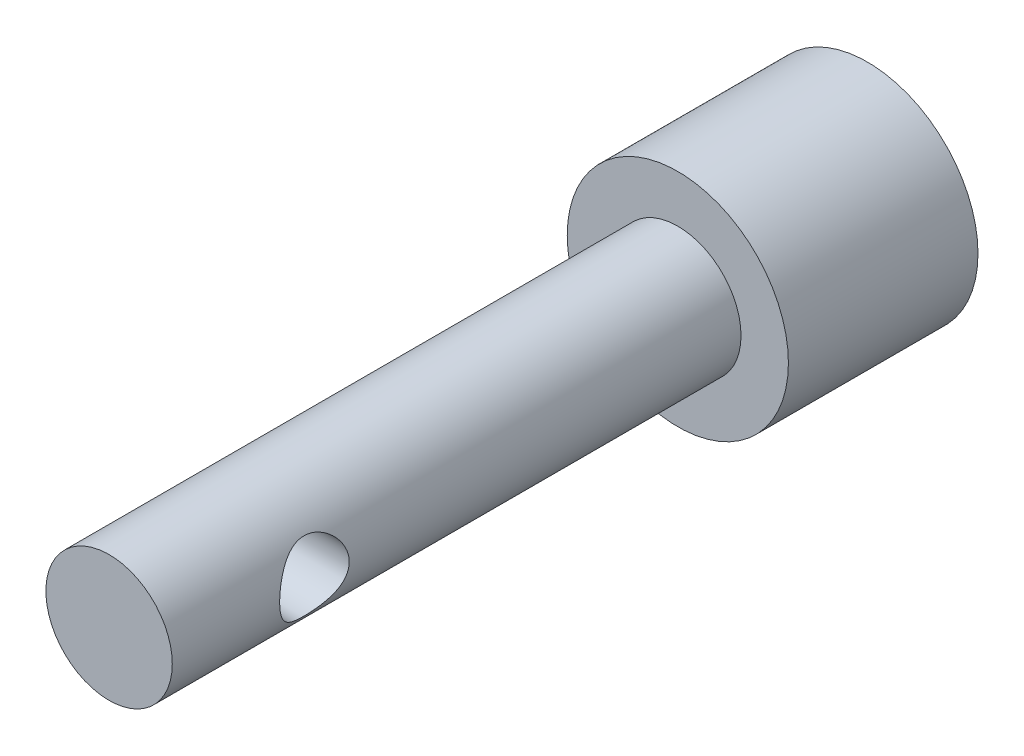
ISO-10303-21;
HEADER;
FILE_DESCRIPTION(('STEP AP214'),'2;1');
FILE_NAME('part.step','',(''),(''),'','','');
FILE_SCHEMA(('AUTOMOTIVE_DESIGN { 1 0 10303 214 1 1 1 1 }'));
ENDSEC;
DATA;
#1=APPLICATION_CONTEXT('core data for automotive mechanical design processes');
#2=APPLICATION_PROTOCOL_DEFINITION('international standard','automotive_design',2000,#1);
#3=PRODUCT_CONTEXT('',#1,'mechanical');
#4=PRODUCT('Part','Part','',(#3));
#5=PRODUCT_RELATED_PRODUCT_CATEGORY('part','',(#4));
#6=PRODUCT_DEFINITION_FORMATION('','',#4);
#7=PRODUCT_DEFINITION_CONTEXT('part definition',#1,'design');
#8=PRODUCT_DEFINITION('design','',#6,#7);
#9=PRODUCT_DEFINITION_SHAPE('','',#8);
#10=(LENGTH_UNIT() NAMED_UNIT(*) SI_UNIT(.MILLI.,.METRE.));
#11=(NAMED_UNIT(*) PLANE_ANGLE_UNIT() SI_UNIT($,.RADIAN.));
#12=(NAMED_UNIT(*) SI_UNIT($,.STERADIAN.) SOLID_ANGLE_UNIT());
#13=UNCERTAINTY_MEASURE_WITH_UNIT(LENGTH_MEASURE(1.E-05),#10,'distance_accuracy_value','');
#14=(GEOMETRIC_REPRESENTATION_CONTEXT(3) GLOBAL_UNCERTAINTY_ASSIGNED_CONTEXT((#13)) GLOBAL_UNIT_ASSIGNED_CONTEXT((#10,
#11,#12)) REPRESENTATION_CONTEXT('',''));
#15=CARTESIAN_POINT('',(0.,0.,0.));
#16=DIRECTION('',(0.,0.,1.));
#17=DIRECTION('',(1.,0.,0.));
#18=AXIS2_PLACEMENT_3D('',#15,#16,#17);
#19=CARTESIAN_POINT('',(0.,0.,6.));
#20=DIRECTION('',(0.,0.,-1.));
#21=DIRECTION('',(-1.,0.,0.));
#22=AXIS2_PLACEMENT_3D('',#19,#20,#21);
#23=CYLINDRICAL_SURFACE('',#22,3.5);
#24=CARTESIAN_POINT('',(0.,0.,6.));
#25=DIRECTION('',(0.,0.,1.));
#26=DIRECTION('',(1.,0.,0.));
#27=AXIS2_PLACEMENT_3D('',#24,#25,#26);
#28=CIRCLE('',#27,3.5);
#29=CARTESIAN_POINT('',(3.5,0.,6.));
#30=VERTEX_POINT('',#29);
#31=EDGE_CURVE('E47',#30,#30,#28,.T.);
#32=ORIENTED_EDGE('',*,*,#31,.F.);
#33=EDGE_LOOP('',(#32));
#34=FACE_BOUND('',#33,.T.);
#35=CARTESIAN_POINT('',(0.,0.,0.));
#36=DIRECTION('',(0.,0.,1.));
#37=DIRECTION('',(1.,0.,0.));
#38=AXIS2_PLACEMENT_3D('',#35,#36,#37);
#39=CIRCLE('',#38,3.5);
#40=CARTESIAN_POINT('',(3.5,0.,0.));
#41=VERTEX_POINT('',#40);
#42=EDGE_CURVE('E53',#41,#41,#39,.T.);
#43=ORIENTED_EDGE('',*,*,#42,.T.);
#44=EDGE_LOOP('',(#43));
#45=FACE_BOUND('',#44,.T.);
#46=ADVANCED_FACE('F31',(#34,#45),#23,.T.);
#47=CARTESIAN_POINT('',(0.,0.,6.));
#48=DIRECTION('',(0.,0.,1.));
#49=DIRECTION('',(1.,0.,0.));
#50=AXIS2_PLACEMENT_3D('',#47,#48,#49);
#51=PLANE('',#50);
#52=CARTESIAN_POINT('',(0.,0.,6.));
#53=DIRECTION('',(0.,0.,1.));
#54=DIRECTION('',(1.,0.,0.));
#55=AXIS2_PLACEMENT_3D('',#52,#53,#54);
#56=CIRCLE('',#55,2.);
#57=CARTESIAN_POINT('',(2.,0.,6.));
#58=VERTEX_POINT('',#57);
#59=EDGE_CURVE('E43',#58,#58,#56,.T.);
#60=ORIENTED_EDGE('',*,*,#59,.F.);
#61=EDGE_LOOP('',(#60));
#62=FACE_BOUND('',#61,.T.);
#63=ORIENTED_EDGE('',*,*,#31,.T.);
#64=EDGE_LOOP('',(#63));
#65=FACE_BOUND('',#64,.T.);
#66=ADVANCED_FACE('F77',(#62,#65),#51,.T.);
#67=CARTESIAN_POINT('',(0.,0.,0.));
#68=DIRECTION('',(0.,0.,1.));
#69=DIRECTION('',(1.,0.,0.));
#70=AXIS2_PLACEMENT_3D('',#67,#68,#69);
#71=PLANE('',#70);
#72=CARTESIAN_POINT('',(0.,0.,0.));
#73=DIRECTION('',(0.,0.,-1.));
#74=DIRECTION('',(-1.,0.,0.));
#75=AXIS2_PLACEMENT_3D('',#72,#73,#74);
#76=CIRCLE('',#75,2.3);
#77=CARTESIAN_POINT('',(-2.3,0.,0.));
#78=VERTEX_POINT('',#77);
#79=EDGE_CURVE('E95',#78,#78,#76,.T.);
#80=ORIENTED_EDGE('',*,*,#79,.F.);
#81=EDGE_LOOP('',(#80));
#82=FACE_BOUND('',#81,.T.);
#83=ORIENTED_EDGE('',*,*,#42,.F.);
#84=EDGE_LOOP('',(#83));
#85=FACE_BOUND('',#84,.T.);
#86=ADVANCED_FACE('F73',(#82,#85),#71,.F.);
#87=CARTESIAN_POINT('',(0.,0.,24.));
#88=DIRECTION('',(0.,0.,-1.));
#89=DIRECTION('',(-1.,0.,0.));
#90=AXIS2_PLACEMENT_3D('',#87,#88,#89);
#91=CYLINDRICAL_SURFACE('',#90,2.);
#92=CARTESIAN_POINT('',(2.,0.,20.6));
#93=CARTESIAN_POINT('',(1.99999675924308,0.0571132983637054,20.5999964110813));
#94=CARTESIAN_POINT('',(1.99752868170342,0.114272714137144,20.5955262362727));
#95=CARTESIAN_POINT('',(1.98789855994148,0.226857367817319,20.5778651898464));
#96=CARTESIAN_POINT('',(1.98073010854729,0.282280130253228,20.5646624144346));
#97=CARTESIAN_POINT('',(1.96243812463521,0.389601051952438,20.5302303571189));
#98=CARTESIAN_POINT('',(1.95133089970991,0.44151270844495,20.5090341475802));
#99=CARTESIAN_POINT('',(1.92614108353208,0.540938827090506,20.4594142212174));
#100=CARTESIAN_POINT('',(1.91205836516769,0.588453101264448,20.4309901956133));
#101=CARTESIAN_POINT('',(1.88102168662336,0.681410795715168,20.3655231112503));
#102=CARTESIAN_POINT('',(1.86393685342201,0.726486915618606,20.3280216503706));
#103=CARTESIAN_POINT('',(1.82916903148557,0.810057561556779,20.2464722610266));
#104=CARTESIAN_POINT('',(1.81148550185214,0.848545934897066,20.2024182837536));
#105=CARTESIAN_POINT('',(1.77547930553327,0.921679451273308,20.1038493427182));
#106=CARTESIAN_POINT('',(1.757265310528,0.955572384755909,20.0487313590102));
#107=CARTESIAN_POINT('',(1.72452224317789,1.01347698490626,19.9325150895782));
#108=CARTESIAN_POINT('',(1.70999026263348,1.0374964594112,19.8714215767618));
#109=CARTESIAN_POINT('',(1.68775650057705,1.07326593950759,19.7488203677151));
#110=CARTESIAN_POINT('',(1.67968128236562,1.08569508898053,19.6875825643648));
#111=CARTESIAN_POINT('',(1.67039270422593,1.09994080420756,19.5634070342956));
#112=CARTESIAN_POINT('',(1.66916950596314,1.10177258610198,19.5004718753173));
#113=CARTESIAN_POINT('',(1.67343764484105,1.09526666719243,19.3850477621669));
#114=CARTESIAN_POINT('',(1.67793532909928,1.08843438295616,19.3324268276671));
#115=CARTESIAN_POINT('',(1.69135685033582,1.06745759351263,19.2292470533978));
#116=CARTESIAN_POINT('',(1.70028270327645,1.05330975771273,19.1786891642039));
#117=CARTESIAN_POINT('',(1.72170753964095,1.0179176089501,19.0796784533327));
#118=CARTESIAN_POINT('',(1.73427940344615,0.996526887131075,19.0312945081385));
#119=CARTESIAN_POINT('',(1.76160601646088,0.947382866660588,18.9385526529354));
#120=CARTESIAN_POINT('',(1.77636170690481,0.919626821691072,18.8941964922787));
#121=CARTESIAN_POINT('',(1.8091936056527,0.853455662743702,18.8034034776133));
#122=CARTESIAN_POINT('',(1.82742638095051,0.814049722616955,18.7577426320771));
#123=CARTESIAN_POINT('',(1.86331585258471,0.728163547976675,18.6733156128991));
#124=CARTESIAN_POINT('',(1.88097214812395,0.681678513773094,18.6345541560717));
#125=CARTESIAN_POINT('',(1.91514756035154,0.579070027867293,18.5625234488777));
#126=CARTESIAN_POINT('',(1.93151098770795,0.522509240968697,18.5297969062474));
#127=CARTESIAN_POINT('',(1.95981018910102,0.403568251763489,18.4746128310417));
#128=CARTESIAN_POINT('',(1.97175012386492,0.341193587463996,18.4521456438889));
#129=CARTESIAN_POINT('',(1.98888897082801,0.218604691987318,18.4202585263745));
#130=CARTESIAN_POINT('',(1.99461215188408,0.158730320348859,18.4098182989883));
#131=CARTESIAN_POINT('',(2.00055584441335,0.0378216889616753,18.3989794475287));
#132=CARTESIAN_POINT('',(2.00077987218944,-0.023211804622957,18.3985744066921));
#133=CARTESIAN_POINT('',(1.99596118554524,-0.13832491676724,18.4073563422037));
#134=CARTESIAN_POINT('',(1.99143106391449,-0.192501184158294,18.4156097341879));
#135=CARTESIAN_POINT('',(1.9783119588675,-0.298559233083234,18.4398950648884));
#136=CARTESIAN_POINT('',(1.96972256491388,-0.350440781958608,18.4559277903776));
#137=CARTESIAN_POINT('',(1.94899585358496,-0.451835605243937,18.4955717439678));
#138=CARTESIAN_POINT('',(1.93678316763217,-0.501269493963586,18.5193451303646));
#139=CARTESIAN_POINT('',(1.90989476735531,-0.595575466499803,18.5735808975332));
#140=CARTESIAN_POINT('',(1.89521815331033,-0.640445874282739,18.6040457229891));
#141=CARTESIAN_POINT('',(1.86280221062633,-0.729703041926061,18.6746964760922));
#142=CARTESIAN_POINT('',(1.84490394898361,-0.773473362505451,18.7155888557727));
#143=CARTESIAN_POINT('',(1.80910293824503,-0.85386608675192,18.803949619785));
#144=CARTESIAN_POINT('',(1.79120020370973,-0.890481038324776,18.8514247728549));
#145=CARTESIAN_POINT('',(1.7559058367425,-0.958315027111076,18.9561094622714));
#146=CARTESIAN_POINT('',(1.73866197158591,-0.988893845528661,19.0137887179169));
#147=CARTESIAN_POINT('',(1.70882042661936,-1.03961917769188,19.1346627198058));
#148=CARTESIAN_POINT('',(1.69621598702366,-1.05978088692977,19.1978492742666));
#149=CARTESIAN_POINT('',(1.67883613638257,-1.08708308369362,19.3215082517237));
#150=CARTESIAN_POINT('',(1.67342014768831,-1.09529651711391,19.381649853693));
#151=CARTESIAN_POINT('',(1.66924062339871,-1.10166023274854,19.5026736461921));
#152=CARTESIAN_POINT('',(1.67047137736522,-1.09981915311486,19.5635551561819));
#153=CARTESIAN_POINT('',(1.67871913798272,-1.08717127824635,19.6754796810369));
#154=CARTESIAN_POINT('',(1.68492582745766,-1.07761883611353,19.7267339823549));
#155=CARTESIAN_POINT('',(1.70128097168541,-1.05160719986521,19.8267969459739));
#156=CARTESIAN_POINT('',(1.71143104554587,-1.0351451685295,19.875604594402));
#157=CARTESIAN_POINT('',(1.73526499534195,-0.994704078643836,19.9727597641932));
#158=CARTESIAN_POINT('',(1.74912723822164,-0.970326360027856,20.0208959972579));
#159=CARTESIAN_POINT('',(1.77863114530158,-0.91512339730325,20.1127173476751));
#160=CARTESIAN_POINT('',(1.79427375178188,-0.88429473164349,20.1564000845553));
#161=CARTESIAN_POINT('',(1.82850690710462,-0.811433379245057,20.2452331596692));
#162=CARTESIAN_POINT('',(1.84717497232162,-0.768401762627388,20.289538823315));
#163=CARTESIAN_POINT('',(1.8832440998029,-0.675195673587143,20.3705896181383));
#164=CARTESIAN_POINT('',(1.90064424663484,-0.625016116121916,20.4073293209931));
#165=CARTESIAN_POINT('',(1.93298792825492,-0.516591509830361,20.473292022683));
#166=CARTESIAN_POINT('',(1.94782493561387,-0.458126594931796,20.5022090429478));
#167=CARTESIAN_POINT('',(1.97252278605601,-0.33614909362183,20.5494064762103));
#168=CARTESIAN_POINT('',(1.98239638103224,-0.272649932634819,20.5677141651786));
#169=CARTESIAN_POINT('',(1.99274289837176,-0.173673745678198,20.5867613720092));
#170=CARTESIAN_POINT('',(1.99545338889598,-0.139188704288959,20.5917149546751));
#171=CARTESIAN_POINT('',(1.99908291729893,-0.069808182266717,20.5983353418803));
#172=CARTESIAN_POINT('',(2.00000198103772,-0.0349127075658214,20.6000021938651));
#173=CARTESIAN_POINT('',(2.,0.,20.6));
#174=B_SPLINE_CURVE_WITH_KNOTS('',3,(#92,#93,#94,#95,#96,#97,#98,#99,#100,#101,#102,#103,#104,
#105,#106,#107,#108,#109,#110,#111,#112,#113,#114,#115,#116,#117,#118,#119,#120,#121,#122,#123,
#124,#125,#126,#127,#128,#129,#130,#131,#132,#133,#134,#135,#136,#137,#138,#139,#140,#141,#142,
#143,#144,#145,#146,#147,#148,#149,#150,#151,#152,#153,#154,#155,#156,#157,#158,#159,#160,#161,
#162,#163,#164,#165,#166,#167,#168,#169,#170,#171,#172,#173),.UNSPECIFIED.,.T.,.F.,(4,2,2,2,2,2,
2,2,2,2,2,2,2,2,2,2,2,2,2,2,2,2,2,2,2,2,2,2,2,2,2,2,2,2,2,2,2,2,2,2,4),(0.,0.171199344358618,
0.342632540401882,0.51336408792254,0.684102930499837,0.866587011965212,1.04924060721242,
1.24988921906168,1.45037885323008,1.63820507654229,1.82576154410213,1.98477085900252,
2.14385263079869,2.3063638425748,2.46894530214969,2.65717988177281,2.84554265907864,
3.04653860187247,3.24734500543234,3.42944876020858,3.61143607003036,3.77563727928096,
3.93985509869252,4.10776203717806,4.27573042197356,4.46250195720548,4.64946698449144,
4.85095752755103,5.05215331954839,5.23384219794165,5.41537500620962,5.57220088279752,
5.72909121842911,5.89559110105391,6.06217951927695,6.25489989789972,6.44775806886046,
6.64732586662592,6.84637828457194,6.95103200094554,7.05568420658406),.UNSPECIFIED.);
#175=CARTESIAN_POINT('',(2.,0.,20.6));
#176=VERTEX_POINT('',#175);
#177=EDGE_CURVE('E34',#176,#176,#174,.T.);
#178=ORIENTED_EDGE('',*,*,#177,.T.);
#179=EDGE_LOOP('',(#178));
#180=FACE_BOUND('',#179,.T.);
#181=CARTESIAN_POINT('',(-2.,0.,20.6));
#182=CARTESIAN_POINT('',(-1.99999675924308,-0.0571132983637054,20.5999964110813));
#183=CARTESIAN_POINT('',(-1.99752868170342,-0.114272714137144,20.5955262362727));
#184=CARTESIAN_POINT('',(-1.98789855994148,-0.226857367817319,20.5778651898464));
#185=CARTESIAN_POINT('',(-1.98073010854729,-0.282280130253228,20.5646624144346));
#186=CARTESIAN_POINT('',(-1.96243812463521,-0.389601051952438,20.5302303571189));
#187=CARTESIAN_POINT('',(-1.95133089970991,-0.44151270844495,20.5090341475802));
#188=CARTESIAN_POINT('',(-1.92614108353208,-0.540938827090506,20.4594142212174));
#189=CARTESIAN_POINT('',(-1.91205836516769,-0.588453101264448,20.4309901956133));
#190=CARTESIAN_POINT('',(-1.88102168662336,-0.681410795715168,20.3655231112503));
#191=CARTESIAN_POINT('',(-1.86393685342201,-0.726486915618606,20.3280216503706));
#192=CARTESIAN_POINT('',(-1.82916903148557,-0.810057561556779,20.2464722610266));
#193=CARTESIAN_POINT('',(-1.81148550185214,-0.848545934897066,20.2024182837536));
#194=CARTESIAN_POINT('',(-1.77547930553327,-0.921679451273308,20.1038493427182));
#195=CARTESIAN_POINT('',(-1.757265310528,-0.955572384755909,20.0487313590102));
#196=CARTESIAN_POINT('',(-1.72452224317789,-1.01347698490626,19.9325150895782));
#197=CARTESIAN_POINT('',(-1.70999026263348,-1.0374964594112,19.8714215767618));
#198=CARTESIAN_POINT('',(-1.68775650057705,-1.07326593950759,19.7488203677151));
#199=CARTESIAN_POINT('',(-1.67968128236562,-1.08569508898053,19.6875825643648));
#200=CARTESIAN_POINT('',(-1.67039270422593,-1.09994080420756,19.5634070342956));
#201=CARTESIAN_POINT('',(-1.66916950596314,-1.10177258610198,19.5004718753173));
#202=CARTESIAN_POINT('',(-1.67343764484105,-1.09526666719243,19.3850477621669));
#203=CARTESIAN_POINT('',(-1.67793532909928,-1.08843438295616,19.3324268276671));
#204=CARTESIAN_POINT('',(-1.69135685033582,-1.06745759351263,19.2292470533978));
#205=CARTESIAN_POINT('',(-1.70028270327645,-1.05330975771273,19.1786891642039));
#206=CARTESIAN_POINT('',(-1.72170753964095,-1.0179176089501,19.0796784533327));
#207=CARTESIAN_POINT('',(-1.73427940344615,-0.996526887131075,19.0312945081385));
#208=CARTESIAN_POINT('',(-1.76160601646088,-0.947382866660588,18.9385526529354));
#209=CARTESIAN_POINT('',(-1.77636170690481,-0.919626821691072,18.8941964922787));
#210=CARTESIAN_POINT('',(-1.8091936056527,-0.853455662743702,18.8034034776133));
#211=CARTESIAN_POINT('',(-1.82742638095051,-0.814049722616955,18.7577426320771));
#212=CARTESIAN_POINT('',(-1.86331585258471,-0.728163547976675,18.6733156128991));
#213=CARTESIAN_POINT('',(-1.88097214812395,-0.681678513773094,18.6345541560717));
#214=CARTESIAN_POINT('',(-1.91514756035154,-0.579070027867293,18.5625234488777));
#215=CARTESIAN_POINT('',(-1.93151098770795,-0.522509240968697,18.5297969062474));
#216=CARTESIAN_POINT('',(-1.95981018910102,-0.403568251763489,18.4746128310417));
#217=CARTESIAN_POINT('',(-1.97175012386492,-0.341193587463996,18.4521456438889));
#218=CARTESIAN_POINT('',(-1.98888897082801,-0.218604691987318,18.4202585263745));
#219=CARTESIAN_POINT('',(-1.99461215188408,-0.158730320348859,18.4098182989883));
#220=CARTESIAN_POINT('',(-2.00055584441335,-0.0378216889616753,18.3989794475287));
#221=CARTESIAN_POINT('',(-2.00077987218944,0.023211804622957,18.3985744066921));
#222=CARTESIAN_POINT('',(-1.99596118554524,0.13832491676724,18.4073563422037));
#223=CARTESIAN_POINT('',(-1.99143106391449,0.192501184158294,18.4156097341879));
#224=CARTESIAN_POINT('',(-1.9783119588675,0.298559233083234,18.4398950648884));
#225=CARTESIAN_POINT('',(-1.96972256491388,0.350440781958608,18.4559277903776));
#226=CARTESIAN_POINT('',(-1.94899585358496,0.451835605243937,18.4955717439678));
#227=CARTESIAN_POINT('',(-1.93678316763217,0.501269493963586,18.5193451303646));
#228=CARTESIAN_POINT('',(-1.90989476735531,0.595575466499803,18.5735808975332));
#229=CARTESIAN_POINT('',(-1.89521815331033,0.640445874282739,18.6040457229891));
#230=CARTESIAN_POINT('',(-1.86280221062633,0.729703041926061,18.6746964760922));
#231=CARTESIAN_POINT('',(-1.84490394898361,0.773473362505451,18.7155888557727));
#232=CARTESIAN_POINT('',(-1.80910293824503,0.85386608675192,18.803949619785));
#233=CARTESIAN_POINT('',(-1.79120020370973,0.890481038324776,18.8514247728549));
#234=CARTESIAN_POINT('',(-1.7559058367425,0.958315027111076,18.9561094622714));
#235=CARTESIAN_POINT('',(-1.73866197158591,0.988893845528661,19.0137887179169));
#236=CARTESIAN_POINT('',(-1.70882042661936,1.03961917769188,19.1346627198058));
#237=CARTESIAN_POINT('',(-1.69621598702366,1.05978088692977,19.1978492742666));
#238=CARTESIAN_POINT('',(-1.67883613638257,1.08708308369362,19.3215082517237));
#239=CARTESIAN_POINT('',(-1.67342014768831,1.09529651711391,19.381649853693));
#240=CARTESIAN_POINT('',(-1.66924062339871,1.10166023274854,19.5026736461921));
#241=CARTESIAN_POINT('',(-1.67047137736522,1.09981915311486,19.5635551561819));
#242=CARTESIAN_POINT('',(-1.67871913798272,1.08717127824635,19.6754796810369));
#243=CARTESIAN_POINT('',(-1.68492582745766,1.07761883611353,19.7267339823549));
#244=CARTESIAN_POINT('',(-1.70128097168541,1.05160719986521,19.8267969459739));
#245=CARTESIAN_POINT('',(-1.71143104554587,1.0351451685295,19.875604594402));
#246=CARTESIAN_POINT('',(-1.73526499534195,0.994704078643836,19.9727597641932));
#247=CARTESIAN_POINT('',(-1.74912723822164,0.970326360027856,20.0208959972579));
#248=CARTESIAN_POINT('',(-1.77863114530158,0.91512339730325,20.1127173476751));
#249=CARTESIAN_POINT('',(-1.79427375178188,0.88429473164349,20.1564000845553));
#250=CARTESIAN_POINT('',(-1.82850690710462,0.811433379245057,20.2452331596692));
#251=CARTESIAN_POINT('',(-1.84717497232162,0.768401762627388,20.289538823315));
#252=CARTESIAN_POINT('',(-1.8832440998029,0.675195673587143,20.3705896181383));
#253=CARTESIAN_POINT('',(-1.90064424663484,0.625016116121916,20.4073293209931));
#254=CARTESIAN_POINT('',(-1.93298792825492,0.516591509830361,20.473292022683));
#255=CARTESIAN_POINT('',(-1.94782493561387,0.458126594931796,20.5022090429478));
#256=CARTESIAN_POINT('',(-1.97252278605601,0.33614909362183,20.5494064762103));
#257=CARTESIAN_POINT('',(-1.98239638103224,0.272649932634819,20.5677141651786));
#258=CARTESIAN_POINT('',(-1.99274289837176,0.173673745678198,20.5867613720092));
#259=CARTESIAN_POINT('',(-1.99545338889598,0.139188704288959,20.5917149546751));
#260=CARTESIAN_POINT('',(-1.99908291729893,0.069808182266717,20.5983353418803));
#261=CARTESIAN_POINT('',(-2.00000198103772,0.0349127075658214,20.6000021938651));
#262=CARTESIAN_POINT('',(-2.,0.,20.6));
#263=B_SPLINE_CURVE_WITH_KNOTS('',3,(#181,#182,#183,#184,#185,#186,#187,#188,#189,#190,#191,
#192,#193,#194,#195,#196,#197,#198,#199,#200,#201,#202,#203,#204,#205,#206,#207,#208,#209,#210,
#211,#212,#213,#214,#215,#216,#217,#218,#219,#220,#221,#222,#223,#224,#225,#226,#227,#228,#229,
#230,#231,#232,#233,#234,#235,#236,#237,#238,#239,#240,#241,#242,#243,#244,#245,#246,#247,#248,
#249,#250,#251,#252,#253,#254,#255,#256,#257,#258,#259,#260,#261,#262),.UNSPECIFIED.,.T.,.F.,(4,
2,2,2,2,2,2,2,2,2,2,2,2,2,2,2,2,2,2,2,2,2,2,2,2,2,2,2,2,2,2,2,2,2,2,2,2,2,2,2,4),(0.,
0.171199344358618,0.342632540401882,0.51336408792254,0.684102930499837,0.866587011965212,
1.04924060721242,1.24988921906168,1.45037885323008,1.63820507654229,1.82576154410213,
1.98477085900252,2.14385263079869,2.3063638425748,2.46894530214969,2.65717988177281,
2.84554265907864,3.04653860187247,3.24734500543234,3.42944876020858,3.61143607003036,
3.77563727928096,3.93985509869252,4.10776203717806,4.27573042197356,4.46250195720548,
4.64946698449144,4.85095752755103,5.05215331954839,5.23384219794165,5.41537500620962,
5.57220088279752,5.72909121842911,5.89559110105391,6.06217951927695,6.25489989789972,
6.44775806886046,6.64732586662592,6.84637828457194,6.95103200094554,7.05568420658406),.UNSPECIFIED.);
#264=CARTESIAN_POINT('',(-2.,0.,20.6));
#265=VERTEX_POINT('',#264);
#266=EDGE_CURVE('E10',#265,#265,#263,.T.);
#267=ORIENTED_EDGE('',*,*,#266,.T.);
#268=EDGE_LOOP('',(#267));
#269=FACE_BOUND('',#268,.T.);
#270=CARTESIAN_POINT('',(0.,0.,24.));
#271=DIRECTION('',(0.,0.,1.));
#272=DIRECTION('',(1.,0.,0.));
#273=AXIS2_PLACEMENT_3D('',#270,#271,#272);
#274=CIRCLE('',#273,2.);
#275=CARTESIAN_POINT('',(2.,0.,24.));
#276=VERTEX_POINT('',#275);
#277=EDGE_CURVE('E89',#276,#276,#274,.T.);
#278=ORIENTED_EDGE('',*,*,#277,.F.);
#279=EDGE_LOOP('',(#278));
#280=FACE_BOUND('',#279,.T.);
#281=ORIENTED_EDGE('',*,*,#59,.T.);
#282=EDGE_LOOP('',(#281));
#283=FACE_BOUND('',#282,.T.);
#284=ADVANCED_FACE('F55',(#180,#269,#280,#283),#91,.T.);
#285=CARTESIAN_POINT('',(0.,0.,24.));
#286=DIRECTION('',(0.,0.,1.));
#287=DIRECTION('',(1.,0.,0.));
#288=AXIS2_PLACEMENT_3D('',#285,#286,#287);
#289=PLANE('',#288);
#290=ORIENTED_EDGE('',*,*,#277,.T.);
#291=EDGE_LOOP('',(#290));
#292=FACE_BOUND('',#291,.T.);
#293=ADVANCED_FACE('F64',(#292),#289,.T.);
#294=CARTESIAN_POINT('',(3.5,0.,19.5));
#295=DIRECTION('',(-1.,0.,0.));
#296=DIRECTION('',(0.,0.,1.));
#297=AXIS2_PLACEMENT_3D('',#294,#295,#296);
#298=CYLINDRICAL_SURFACE('',#297,1.1);
#299=ORIENTED_EDGE('',*,*,#177,.F.);
#300=EDGE_LOOP('',(#299));
#301=FACE_BOUND('',#300,.T.);
#302=ORIENTED_EDGE('',*,*,#266,.F.);
#303=EDGE_LOOP('',(#302));
#304=FACE_BOUND('',#303,.T.);
#305=ADVANCED_FACE('F59',(#301,#304),#298,.F.);
#306=CARTESIAN_POINT('',(0.,0.,3.));
#307=DIRECTION('',(0.,0.,-1.));
#308=DIRECTION('',(-1.,0.,0.));
#309=AXIS2_PLACEMENT_3D('',#306,#307,#308);
#310=CYLINDRICAL_SURFACE('',#309,2.3);
#311=CARTESIAN_POINT('',(0.,0.,3.));
#312=DIRECTION('',(0.,0.,-1.));
#313=DIRECTION('',(-1.,0.,0.));
#314=AXIS2_PLACEMENT_3D('',#311,#312,#313);
#315=CIRCLE('',#314,2.3);
#316=CARTESIAN_POINT('',(-2.3,0.,3.));
#317=VERTEX_POINT('',#316);
#318=EDGE_CURVE('E93',#317,#317,#315,.T.);
#319=ORIENTED_EDGE('',*,*,#318,.F.);
#320=EDGE_LOOP('',(#319));
#321=FACE_BOUND('',#320,.T.);
#322=ORIENTED_EDGE('',*,*,#79,.T.);
#323=EDGE_LOOP('',(#322));
#324=FACE_BOUND('',#323,.T.);
#325=ADVANCED_FACE('F63',(#321,#324),#310,.F.);
#326=CARTESIAN_POINT('',(0.,0.,3.));
#327=DIRECTION('',(0.,0.,-1.));
#328=DIRECTION('',(-1.,0.,0.));
#329=AXIS2_PLACEMENT_3D('',#326,#327,#328);
#330=PLANE('',#329);
#331=ORIENTED_EDGE('',*,*,#318,.T.);
#332=EDGE_LOOP('',(#331));
#333=FACE_BOUND('',#332,.T.);
#334=ADVANCED_FACE('F101',(#333),#330,.T.);
#335=CLOSED_SHELL('',(#46,#66,#86,#284,#293,#305,#325,#334));
#336=MANIFOLD_SOLID_BREP('B2',#335);
#337=ADVANCED_BREP_SHAPE_REPRESENTATION('',(#18,#336),#14);
#338=SHAPE_DEFINITION_REPRESENTATION(#9,#337);
ENDSEC;
END-ISO-10303-21;
